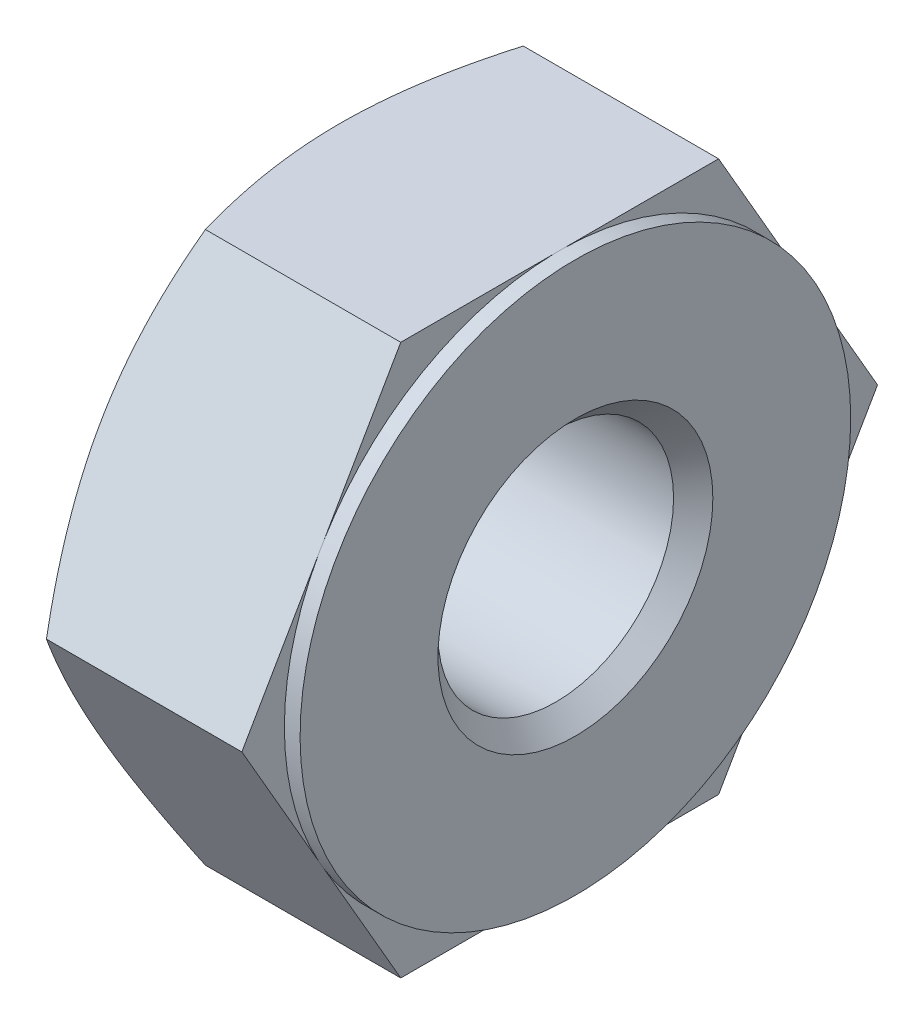
ISO-10303-21;
HEADER;
FILE_DESCRIPTION(('STEP AP214'),'2;1');
FILE_NAME('part.step','',(''),(''),'','','');
FILE_SCHEMA(('AUTOMOTIVE_DESIGN { 1 0 10303 214 1 1 1 1 }'));
ENDSEC;
DATA;
#1=APPLICATION_CONTEXT('core data for automotive mechanical design processes');
#2=APPLICATION_PROTOCOL_DEFINITION('international standard','automotive_design',2000,#1);
#3=PRODUCT_CONTEXT('',#1,'mechanical');
#4=PRODUCT('Part','Part','',(#3));
#5=PRODUCT_RELATED_PRODUCT_CATEGORY('part','',(#4));
#6=PRODUCT_DEFINITION_FORMATION('','',#4);
#7=PRODUCT_DEFINITION_CONTEXT('part definition',#1,'design');
#8=PRODUCT_DEFINITION('design','',#6,#7);
#9=PRODUCT_DEFINITION_SHAPE('','',#8);
#10=(LENGTH_UNIT() NAMED_UNIT(*) SI_UNIT(.MILLI.,.METRE.));
#11=(NAMED_UNIT(*) PLANE_ANGLE_UNIT() SI_UNIT($,.RADIAN.));
#12=(NAMED_UNIT(*) SI_UNIT($,.STERADIAN.) SOLID_ANGLE_UNIT());
#13=UNCERTAINTY_MEASURE_WITH_UNIT(LENGTH_MEASURE(1.E-05),#10,'distance_accuracy_value','');
#14=(GEOMETRIC_REPRESENTATION_CONTEXT(3) GLOBAL_UNCERTAINTY_ASSIGNED_CONTEXT((#13)) GLOBAL_UNIT_ASSIGNED_CONTEXT((#10,
#11,#12)) REPRESENTATION_CONTEXT('',''));
#15=CARTESIAN_POINT('',(0.,0.,0.));
#16=DIRECTION('',(0.,0.,1.));
#17=DIRECTION('',(1.,0.,0.));
#18=AXIS2_PLACEMENT_3D('',#15,#16,#17);
#19=CARTESIAN_POINT('',(9.01523367511831,0.,1.9501205605213));
#20=DIRECTION('',(-1.,0.,0.));
#21=DIRECTION('',(0.,0.,1.));
#22=AXIS2_PLACEMENT_3D('',#19,#20,#21);
#23=PLANE('',#22);
#24=CARTESIAN_POINT('',(9.01523367511832,0.,5.99689052934928));
#25=DIRECTION('',(1.,0.,0.));
#26=DIRECTION('',(0.,0.,-1.));
#27=AXIS2_PLACEMENT_3D('',#24,#25,#26);
#28=CIRCLE('',#27,3.50531808450061);
#29=CARTESIAN_POINT('',(9.01523367511831,1.81350627886718,2.99714889880234));
#30=VERTEX_POINT('',#29);
#31=CARTESIAN_POINT('',(9.01523367511832,3.504605596277,5.92621883720174));
#32=VERTEX_POINT('',#31);
#33=EDGE_CURVE('E232',#30,#32,#28,.T.);
#34=ORIENTED_EDGE('',*,*,#33,.F.);
#35=DIRECTION('',(0.,0.866025403784438,0.500000000000001));
#36=VECTOR('',#35,1.);
#37=CARTESIAN_POINT('',(9.01523367511831,-0.844426972926903,1.46259042039097));
#38=LINE('',#37,#36);
#39=CARTESIAN_POINT('',(9.01523367511832,3.504605596277,3.9735055449353));
#40=VERTEX_POINT('',#39);
#41=EDGE_CURVE('E187',#30,#40,#38,.T.);
#42=ORIENTED_EDGE('',*,*,#41,.T.);
#43=DIRECTION('',(0.,0.,1.));
#44=VECTOR('',#43,1.);
#45=CARTESIAN_POINT('',(9.01523367511831,3.50460559627702,0.));
#46=LINE('',#45,#44);
#47=EDGE_CURVE('E456',#40,#32,#46,.T.);
#48=ORIENTED_EDGE('',*,*,#47,.T.);
#49=EDGE_LOOP('',(#34,#42,#48));
#50=FACE_BOUND('',#49,.T.);
#51=ADVANCED_FACE('F47',(#50),#23,.F.);
#52=CARTESIAN_POINT('',(9.01523367511832,3.504605596277,6.06756222149684));
#53=VERTEX_POINT('',#52);
#54=CARTESIAN_POINT('',(9.01523367511832,1.81350627886629,8.99663215989675));
#55=VERTEX_POINT('',#54);
#56=EDGE_CURVE('E228',#53,#55,#28,.T.);
#57=ORIENTED_EDGE('',*,*,#56,.F.);
#58=CARTESIAN_POINT('',(9.01523367511832,3.50460559627699,8.0202755137633));
#59=VERTEX_POINT('',#58);
#60=EDGE_CURVE('E353',#53,#59,#46,.T.);
#61=ORIENTED_EDGE('',*,*,#60,.T.);
#62=DIRECTION('',(0.,-0.866025403784442,0.499999999999995));
#63=VECTOR('',#62,1.);
#64=CARTESIAN_POINT('',(9.01523367511832,4.34903256920387,7.532745373633));
#65=LINE('',#64,#63);
#66=EDGE_CURVE('E237',#59,#55,#65,.T.);
#67=ORIENTED_EDGE('',*,*,#66,.T.);
#68=EDGE_LOOP('',(#57,#61,#67));
#69=FACE_BOUND('',#68,.T.);
#70=ADVANCED_FACE('F447',(#69),#23,.F.);
#71=CARTESIAN_POINT('',(9.01523367511832,1.69109931741069,9.06730385204382));
#72=VERTEX_POINT('',#71);
#73=CARTESIAN_POINT('',(9.01523367511832,-1.69109931741071,9.06730385204381));
#74=VERTEX_POINT('',#73);
#75=EDGE_CURVE('E224',#72,#74,#28,.T.);
#76=ORIENTED_EDGE('',*,*,#75,.F.);
#77=CARTESIAN_POINT('',(9.01523367511832,0.,10.0436604981773));
#78=VERTEX_POINT('',#77);
#79=EDGE_CURVE('E243',#72,#78,#65,.T.);
#80=ORIENTED_EDGE('',*,*,#79,.T.);
#81=DIRECTION('',(0.,-0.866025403784435,-0.500000000000007));
#82=VECTOR('',#81,1.);
#83=CARTESIAN_POINT('',(9.01523367511832,-4.34903256920395,7.5327453736329));
#84=LINE('',#83,#82);
#85=EDGE_CURVE('E349',#78,#74,#84,.T.);
#86=ORIENTED_EDGE('',*,*,#85,.T.);
#87=EDGE_LOOP('',(#76,#80,#86));
#88=FACE_BOUND('',#87,.T.);
#89=ADVANCED_FACE('F452',(#88),#23,.F.);
#90=CARTESIAN_POINT('',(9.01523367511832,-1.81350627886635,8.99663215989671));
#91=VERTEX_POINT('',#90);
#92=CARTESIAN_POINT('',(9.01523367511832,-3.504605596277,6.06756222149683));
#93=VERTEX_POINT('',#92);
#94=EDGE_CURVE('E199',#91,#93,#28,.T.);
#95=ORIENTED_EDGE('',*,*,#94,.F.);
#96=CARTESIAN_POINT('',(9.01523367511832,-3.50460559627702,8.02027551376325));
#97=VERTEX_POINT('',#96);
#98=EDGE_CURVE('E475',#91,#97,#84,.T.);
#99=ORIENTED_EDGE('',*,*,#98,.T.);
#100=DIRECTION('',(0.,0.,-1.));
#101=VECTOR('',#100,1.);
#102=CARTESIAN_POINT('',(9.01523367511831,-3.50460559627694,0.));
#103=LINE('',#102,#101);
#104=EDGE_CURVE('E384',#97,#93,#103,.T.);
#105=ORIENTED_EDGE('',*,*,#104,.T.);
#106=EDGE_LOOP('',(#95,#99,#105));
#107=FACE_BOUND('',#106,.T.);
#108=ADVANCED_FACE('F444',(#107),#23,.F.);
#109=CARTESIAN_POINT('',(9.01523367511832,-3.504605596277,5.92621883720165));
#110=VERTEX_POINT('',#109);
#111=CARTESIAN_POINT('',(9.01523367511831,-1.81350627886658,2.99714889880199));
#112=VERTEX_POINT('',#111);
#113=EDGE_CURVE('E196',#110,#112,#28,.T.);
#114=ORIENTED_EDGE('',*,*,#113,.F.);
#115=CARTESIAN_POINT('',(9.01523367511832,-3.50460559627698,3.97350554493526));
#116=VERTEX_POINT('',#115);
#117=EDGE_CURVE('E382',#110,#116,#103,.T.);
#118=ORIENTED_EDGE('',*,*,#117,.T.);
#119=DIRECTION('',(0.,0.866025403784441,-0.499999999999995));
#120=VECTOR('',#119,1.);
#121=CARTESIAN_POINT('',(9.01523367511831,0.844426972926896,1.46259042039098));
#122=LINE('',#121,#120);
#123=EDGE_CURVE('E206',#116,#112,#122,.T.);
#124=ORIENTED_EDGE('',*,*,#123,.T.);
#125=EDGE_LOOP('',(#114,#118,#124));
#126=FACE_BOUND('',#125,.T.);
#127=ADVANCED_FACE('F437',(#126),#23,.F.);
#128=CARTESIAN_POINT('',(6.21523367511831,0.,2.49157244484869));
#129=DIRECTION('',(1.,0.,0.));
#130=DIRECTION('',(0.,0.,-1.));
#131=AXIS2_PLACEMENT_3D('',#128,#129,#130);
#132=PLANE('',#131);
#133=CARTESIAN_POINT('',(6.21523367511832,0.,5.99689052934928));
#134=DIRECTION('',(1.,0.,0.));
#135=DIRECTION('',(0.,0.,-1.));
#136=AXIS2_PLACEMENT_3D('',#133,#134,#135);
#137=CIRCLE('',#136,1.74999999999999);
#138=CARTESIAN_POINT('',(6.21523367511831,0.,4.24689052934929));
#139=VERTEX_POINT('',#138);
#140=EDGE_CURVE('E12',#139,#139,#137,.T.);
#141=ORIENTED_EDGE('',*,*,#140,.T.);
#142=EDGE_LOOP('',(#141));
#143=FACE_BOUND('',#142,.T.);
#144=DIRECTION('',(0.,0.866025403784438,0.500000000000001));
#145=VECTOR('',#144,1.);
#146=CARTESIAN_POINT('',(6.21523367511831,-0.844426972926903,1.46259042039097));
#147=LINE('',#146,#145);
#148=CARTESIAN_POINT('',(6.21523367511831,1.69109931741078,2.92647720665481));
#149=VERTEX_POINT('',#148);
#150=CARTESIAN_POINT('',(6.21523367511831,1.81350627886623,2.9971488988018));
#151=VERTEX_POINT('',#150);
#152=EDGE_CURVE('E300',#149,#151,#147,.T.);
#153=ORIENTED_EDGE('',*,*,#152,.F.);
#154=CARTESIAN_POINT('',(6.21523367511832,0.,5.99689052934929));
#155=DIRECTION('',(-1.,0.,0.));
#156=DIRECTION('',(0.,0.,1.));
#157=AXIS2_PLACEMENT_3D('',#154,#155,#156);
#158=CIRCLE('',#157,3.5053180845006);
#159=CARTESIAN_POINT('',(6.21523367511831,-1.69109931741134,2.92647720665512));
#160=VERTEX_POINT('',#159);
#161=EDGE_CURVE('E319',#149,#160,#158,.T.);
#162=ORIENTED_EDGE('',*,*,#161,.T.);
#163=DIRECTION('',(0.,0.866025403784442,-0.499999999999995));
#164=VECTOR('',#163,1.);
#165=CARTESIAN_POINT('',(6.21523367511831,0.844426972926896,1.46259042039099));
#166=LINE('',#165,#164);
#167=CARTESIAN_POINT('',(6.21523367511831,-1.81350627886564,2.99714889880144));
#168=VERTEX_POINT('',#167);
#169=EDGE_CURVE('E307',#168,#160,#166,.T.);
#170=ORIENTED_EDGE('',*,*,#169,.F.);
#171=CARTESIAN_POINT('',(6.21523367511832,-3.504605596277,5.92621883720222));
#172=VERTEX_POINT('',#171);
#173=EDGE_CURVE('E317',#168,#172,#158,.T.);
#174=ORIENTED_EDGE('',*,*,#173,.T.);
#175=DIRECTION('',(0.,0.,-1.));
#176=VECTOR('',#175,1.);
#177=CARTESIAN_POINT('',(6.21523367511832,-3.50460559627694,0.));
#178=LINE('',#177,#176);
#179=CARTESIAN_POINT('',(6.21523367511832,-3.504605596277,6.0675622214963));
#180=VERTEX_POINT('',#179);
#181=EDGE_CURVE('E303',#180,#172,#178,.T.);
#182=ORIENTED_EDGE('',*,*,#181,.F.);
#183=CARTESIAN_POINT('',(6.21523367511832,-1.81350627886633,8.99663215989673));
#184=VERTEX_POINT('',#183);
#185=EDGE_CURVE('E320',#180,#184,#158,.T.);
#186=ORIENTED_EDGE('',*,*,#185,.T.);
#187=DIRECTION('',(0.,-0.866025403784435,-0.500000000000007));
#188=VECTOR('',#187,1.);
#189=CARTESIAN_POINT('',(6.21523367511832,-4.34903256920395,7.5327453736329));
#190=LINE('',#189,#188);
#191=CARTESIAN_POINT('',(6.21523367511832,-1.69109931741071,9.06730385204381));
#192=VERTEX_POINT('',#191);
#193=EDGE_CURVE('E311',#192,#184,#190,.T.);
#194=ORIENTED_EDGE('',*,*,#193,.F.);
#195=CARTESIAN_POINT('',(6.21523367511832,1.69109931741066,9.06730385204384));
#196=VERTEX_POINT('',#195);
#197=EDGE_CURVE('E326',#192,#196,#158,.T.);
#198=ORIENTED_EDGE('',*,*,#197,.T.);
#199=DIRECTION('',(0.,-0.866025403784442,0.499999999999995));
#200=VECTOR('',#199,1.);
#201=CARTESIAN_POINT('',(6.21523367511832,4.34903256920387,7.532745373633));
#202=LINE('',#201,#200);
#203=CARTESIAN_POINT('',(6.21523367511832,1.81350627886629,8.99663215989675));
#204=VERTEX_POINT('',#203);
#205=EDGE_CURVE('E262',#204,#196,#202,.T.);
#206=ORIENTED_EDGE('',*,*,#205,.F.);
#207=CARTESIAN_POINT('',(6.21523367511832,3.504605596277,6.06756222149635));
#208=VERTEX_POINT('',#207);
#209=EDGE_CURVE('E310',#204,#208,#158,.T.);
#210=ORIENTED_EDGE('',*,*,#209,.T.);
#211=DIRECTION('',(0.,0.,1.));
#212=VECTOR('',#211,1.);
#213=CARTESIAN_POINT('',(6.21523367511832,3.50460559627702,0.));
#214=LINE('',#213,#212);
#215=CARTESIAN_POINT('',(6.21523367511832,3.504605596277,5.92621883720227));
#216=VERTEX_POINT('',#215);
#217=EDGE_CURVE('E314',#216,#208,#214,.T.);
#218=ORIENTED_EDGE('',*,*,#217,.F.);
#219=EDGE_CURVE('E321',#216,#151,#158,.T.);
#220=ORIENTED_EDGE('',*,*,#219,.T.);
#221=EDGE_LOOP('',(#153,#162,#170,#174,#182,#186,#194,#198,#206,#210,#218,#220));
#222=FACE_BOUND('',#221,.T.);
#223=ADVANCED_FACE('F336',(#143,#222),#132,.F.);
#224=CARTESIAN_POINT('',(9.01523367511831,-1.69109931741038,2.92647720665456));
#225=VERTEX_POINT('',#224);
#226=CARTESIAN_POINT('',(9.01523367511831,1.69109931740982,2.92647720665425));
#227=VERTEX_POINT('',#226);
#228=EDGE_CURVE('E63',#225,#227,#28,.T.);
#229=ORIENTED_EDGE('',*,*,#228,.F.);
#230=CARTESIAN_POINT('',(9.01523367511831,0.,1.9501205605213));
#231=VERTEX_POINT('',#230);
#232=EDGE_CURVE('E176',#225,#231,#122,.T.);
#233=ORIENTED_EDGE('',*,*,#232,.T.);
#234=EDGE_CURVE('E173',#231,#227,#38,.T.);
#235=ORIENTED_EDGE('',*,*,#234,.T.);
#236=EDGE_LOOP('',(#229,#233,#235));
#237=FACE_BOUND('',#236,.T.);
#238=ADVANCED_FACE('F175',(#237),#23,.F.);
#239=CARTESIAN_POINT('',(6.52784106628796,0.,5.99689052934929));
#240=DIRECTION('',(1.,0.,0.));
#241=DIRECTION('',(0.,0.,-1.));
#242=AXIS2_PLACEMENT_3D('',#239,#240,#241);
#243=CONICAL_SURFACE('',#242,4.04676996882799,1.0471975511966);
#244=CARTESIAN_POINT('',(6.52790773580793,-0.000199999999997301,1.95000509046747));
#245=CARTESIAN_POINT('',(6.47655198186036,0.153809566516119,2.03892255515332));
#246=CARTESIAN_POINT('',(6.42984577511724,0.309148533972665,2.12860754983));
#247=CARTESIAN_POINT('',(6.34831957460338,0.622516334326462,2.30953053371963));
#248=CARTESIAN_POINT('',(6.31352842188457,0.780550735388633,2.40077173771409));
#249=CARTESIAN_POINT('',(6.25937085826067,1.0946609950491,2.58212338068428));
#250=CARTESIAN_POINT('',(6.23964400125341,1.25068852355232,2.67220591626661));
#251=CARTESIAN_POINT('',(6.21609411511932,1.56347775531863,2.85279486342651));
#252=CARTESIAN_POINT('',(6.21225158478046,1.72023832165344,2.94330061859823));
#253=CARTESIAN_POINT('',(6.22024475829277,2.01315498412356,3.11241613252548));
#254=CARTESIAN_POINT('',(6.23011786674248,2.14935492549422,3.19105120533944));
#255=CARTESIAN_POINT('',(6.26141001837264,2.42086746519949,3.34780904322664));
#256=CARTESIAN_POINT('',(6.28283975133466,2.55617912440269,3.4259312660921));
#257=CARTESIAN_POINT('',(6.33641250191811,2.82825148589846,3.58301231724074));
#258=CARTESIAN_POINT('',(6.36878261611802,2.96497775251995,3.66195126407995));
#259=CARTESIAN_POINT('',(6.44225007523395,3.23639102713107,3.81865179123832));
#260=CARTESIAN_POINT('',(6.48333015744971,3.37108151241666,3.89641537917524));
#261=CARTESIAN_POINT('',(6.52790773580793,3.504805596277,3.97362101498914));
#262=B_SPLINE_CURVE_WITH_KNOTS('',3,(#244,#245,#246,#247,#248,#249,#250,#251,#252,#253,#254,
#255,#256,#257,#258,#259,#260,#261),.UNSPECIFIED.,.F.,.F.,(4,2,2,2,2,2,2,2,4),(0.,
0.555523856766706,1.11238304016832,1.65546014174655,2.1978703083649,2.67016009995162,
3.14288750687598,3.6261008954237,4.10836538614338),.UNSPECIFIED.);
#263=CARTESIAN_POINT('',(6.52784106628796,0.,1.9501205605213));
#264=VERTEX_POINT('',#263);
#265=EDGE_CURVE('E302',#264,#149,#262,.T.);
#266=ORIENTED_EDGE('',*,*,#265,.F.);
#267=CARTESIAN_POINT('',(7.63942238244528,-5.94010134878504,5.37963967325596));
#268=CARTESIAN_POINT('',(7.57998961243419,-5.82997739974507,5.31605958163351));
#269=CARTESIAN_POINT('',(7.52119742724885,-5.7195901265507,5.25232745973963));
#270=CARTESIAN_POINT('',(7.40519501435212,-5.49817790120754,5.12449505183589));
#271=CARTESIAN_POINT('',(7.34798498556296,-5.38715287097476,5.0603947207442));
#272=CARTESIAN_POINT('',(7.23528241265301,-5.16402467671095,4.9315715977222));
#273=CARTESIAN_POINT('',(7.17979595982228,-5.05191919787322,4.86684746933761));
#274=CARTESIAN_POINT('',(7.0711460996325,-4.82686888063744,4.73691460810032));
#275=CARTESIAN_POINT('',(7.01798261860783,-4.71392406898923,4.67170589069165));
#276=CARTESIAN_POINT('',(6.91316583536851,-4.48416401493904,4.53905386163676));
#277=CARTESIAN_POINT('',(6.86158578292259,-4.3673235954558,4.47159601399588));
#278=CARTESIAN_POINT('',(6.76210102525412,-4.13247674431095,4.33600712126907));
#279=CARTESIAN_POINT('',(6.71419610645899,-4.01447038085624,4.2678761155624));
#280=CARTESIAN_POINT('',(6.62296340456288,-3.77724729424417,4.13091530264893));
#281=CARTESIAN_POINT('',(6.57963145832201,-3.6580317821842,4.06208619466953));
#282=CARTESIAN_POINT('',(6.49854858957115,-3.41819489671866,3.9236163042844));
#283=CARTESIAN_POINT('',(6.46079694768049,-3.29757370669169,3.85397562775236));
#284=CARTESIAN_POINT('',(6.37913316402746,-3.0091651131697,3.68746284864583));
#285=CARTESIAN_POINT('',(6.33825214991654,-2.84071633906093,3.59020890356947));
#286=CARTESIAN_POINT('',(6.27274638685567,-2.50142555689638,3.39431927915322));
#287=CARTESIAN_POINT('',(6.24811596006098,-2.33058440604901,3.29568409472282));
#288=CARTESIAN_POINT('',(6.22540922521524,-2.0744090351387,3.14778117536801));
#289=CARTESIAN_POINT('',(6.22020331338452,-1.98952286561289,3.09877212254181));
#290=CARTESIAN_POINT('',(6.21453118856414,-1.81962673074213,3.0006825433399));
#291=CARTESIAN_POINT('',(6.21406492546924,-1.73461676671538,2.95160201772525));
#292=CARTESIAN_POINT('',(6.21789384236217,-1.56467590088275,2.85348661309047));
#293=CARTESIAN_POINT('',(6.22218918830991,-1.47974500193586,2.80445173572096));
#294=CARTESIAN_POINT('',(6.23540917679844,-1.31015190619197,2.70653711624053));
#295=CARTESIAN_POINT('',(6.24433414250601,-1.22548972856798,2.65765738519914));
#296=CARTESIAN_POINT('',(6.27064791023379,-1.02558546786977,2.54224260647287));
#297=CARTESIAN_POINT('',(6.28994123081508,-0.910529990902257,2.47581529587394));
#298=CARTESIAN_POINT('',(6.33581817084866,-0.681517570724018,2.34359491343627));
#299=CARTESIAN_POINT('',(6.36240285010049,-0.56756078970327,2.27780193523796));
#300=CARTESIAN_POINT('',(6.42185905691839,-0.340760831838172,2.14685891851235));
#301=CARTESIAN_POINT('',(6.45473768181666,-0.22791906485642,2.0817096939696));
#302=CARTESIAN_POINT('',(6.52574614887122,-0.00350133763502364,1.95214205874741));
#303=CARTESIAN_POINT('',(6.56387565894073,0.10807470217159,1.88772360212995));
#304=CARTESIAN_POINT('',(6.64495933838875,0.331363265254297,1.75880789012718));
#305=CARTESIAN_POINT('',(6.68796574753002,0.443061466718441,1.69431890344386));
#306=CARTESIAN_POINT('',(6.77760213147093,0.665271472122561,1.56602589700717));
#307=CARTESIAN_POINT('',(6.82422970424994,0.775784008094973,1.50222145461467));
#308=CARTESIAN_POINT('',(6.96854787780255,1.10580649815144,1.31168288114194));
#309=CARTESIAN_POINT('',(7.07069486032152,1.32385690134501,1.18579142216123));
#310=CARTESIAN_POINT('',(7.21392756317926,1.61602591991813,1.01710756063917));
#311=CARTESIAN_POINT('',(7.25149436788595,1.69147344627413,0.973547910987842));
#312=CARTESIAN_POINT('',(7.32750277622736,1.84203644922975,0.886620320701418));
#313=CARTESIAN_POINT('',(7.36594435057548,1.91715193684551,0.84325237370615));
#314=CARTESIAN_POINT('',(7.44318223985778,2.06628794172789,0.75714866114144));
#315=CARTESIAN_POINT('',(7.48197045357195,2.14031161646565,0.714411072605193));
#316=CARTESIAN_POINT('',(7.56021566304786,2.28809507385016,0.629088253702474));
#317=CARTESIAN_POINT('',(7.59967267051865,2.36185485184924,0.586503026019336));
#318=CARTESIAN_POINT('',(7.63942238244528,2.43549575250807,0.543986432200598));
#319=B_SPLINE_CURVE_WITH_KNOTS('',3,(#267,#268,#269,#270,#271,#272,#273,#274,#275,#276,#277,
#278,#279,#280,#281,#282,#283,#284,#285,#286,#287,#288,#289,#290,#291,#292,#293,#294,#295,#296,
#297,#298,#299,#300,#301,#302,#303,#304,#305,#306,#307,#308,#309,#310,#311,#312,#313,#314,#315,
#316,#317,#318),.UNSPECIFIED.,.F.,.F.,(4,2,2,2,2,2,2,2,2,2,2,2,2,2,2,2,2,2,2,2,2,2,2,2,2,4),(0.,
0.421095586095047,0.842243877423023,1.26474176490681,1.68722624448425,2.12050114861326,
2.55375085478938,2.98660267367378,3.41939864304022,4.01512627135809,4.61064564611191,
4.90501583659645,5.19938291514063,5.49376025380307,5.78815814399773,6.19065941980799,
6.5932192302425,6.99623568786597,7.3992266688277,7.80703648914611,8.21457807097681,
9.02945899044465,9.31408130639947,9.59869410739856,9.88028474205919,10.1618803118352),.UNSPECIFIED.);
#320=EDGE_CURVE('E201',#160,#264,#319,.T.);
#321=ORIENTED_EDGE('',*,*,#320,.F.);
#322=ORIENTED_EDGE('',*,*,#161,.F.);
#323=EDGE_LOOP('',(#266,#321,#322));
#324=FACE_BOUND('',#323,.T.);
#325=ADVANCED_FACE('F443',(#324),#243,.T.);
#326=CARTESIAN_POINT('',(6.52784106628796,3.504605596277,3.9735055449353));
#327=VERTEX_POINT('',#326);
#328=EDGE_CURVE('E179',#151,#327,#262,.T.);
#329=ORIENTED_EDGE('',*,*,#328,.F.);
#330=ORIENTED_EDGE('',*,*,#219,.F.);
#331=CARTESIAN_POINT('',(7.46577583410324,3.50460559627701,1.53800979242721));
#332=CARTESIAN_POINT('',(7.40831416214057,3.50460559627701,1.66463292422941));
#333=CARTESIAN_POINT('',(7.35160078393124,3.50460559627701,1.79160201741177));
#334=CARTESIAN_POINT('',(7.24003348945727,3.50460559627701,2.04638074214783));
#335=CARTESIAN_POINT('',(7.18517990977941,3.50460559627701,2.17419052090412));
#336=CARTESIAN_POINT('',(7.07749192627333,3.50460559627701,2.43128880046208));
#337=CARTESIAN_POINT('',(7.02466689883435,3.50460559627701,2.56058124549351));
#338=CARTESIAN_POINT('',(6.92178133211271,3.50460559627701,2.82025714497044));
#339=CARTESIAN_POINT('',(6.87172066577147,3.50460559627701,2.95064054895437));
#340=CARTESIAN_POINT('',(6.77519152620521,3.50460559627701,3.21208299709996));
#341=CARTESIAN_POINT('',(6.7287080517677,3.50460559627701,3.3431364484971));
#342=CARTESIAN_POINT('',(6.63985141318327,3.50460559627701,3.60662666266784));
#343=CARTESIAN_POINT('',(6.59747851124213,3.50460559627701,3.73906351308981));
#344=CARTESIAN_POINT('',(6.47797445741147,3.504605596277,4.13831115026192));
#345=CARTESIAN_POINT('',(6.40829354517167,3.504605596277,4.40748800786949));
#346=CARTESIAN_POINT('',(6.31341116808281,3.504605596277,4.87472216300438));
#347=CARTESIAN_POINT('',(6.28120186405437,3.504605596277,5.0713347725773));
#348=CARTESIAN_POINT('',(6.23480142375391,3.504605596277,5.46669389494947));
#349=CARTESIAN_POINT('',(6.22060426367489,3.504605596277,5.66543967191703));
#350=CARTESIAN_POINT('',(6.21193307293221,3.504605596277,6.06327229585966));
#351=CARTESIAN_POINT('',(6.21744844621454,3.504605596277,6.26235890211959));
#352=CARTESIAN_POINT('',(6.24748241363508,3.504605596277,6.65905715324727));
#353=CARTESIAN_POINT('',(6.27200417509332,3.504605596277,6.85666854673606));
#354=CARTESIAN_POINT('',(6.35374710265866,3.50460559627699,7.34752890351585));
#355=CARTESIAN_POINT('',(6.42119863640871,3.50460559627699,7.63905438129734));
#356=CARTESIAN_POINT('',(6.54149090366201,3.50460559627699,8.0710152970608));
#357=CARTESIAN_POINT('',(6.58484503081389,3.50460559627699,8.21430255336605));
#358=CARTESIAN_POINT('',(6.67672394788257,3.50460559627699,8.49921715356136));
#359=CARTESIAN_POINT('',(6.7252483744038,3.50460559627699,8.64084461333493));
#360=CARTESIAN_POINT('',(6.82702869058875,3.50460559627699,8.92421309873922));
#361=CARTESIAN_POINT('',(6.8803326262009,3.50460559627699,9.06593665534471));
#362=CARTESIAN_POINT('',(6.9903528053279,3.50460559627699,9.34805929792589));
#363=CARTESIAN_POINT('',(7.04706926388774,3.50460559627699,9.48845829978661));
#364=CARTESIAN_POINT('',(7.16288221748141,3.50460559627699,9.76723924077303));
#365=CARTESIAN_POINT('',(7.22196166606334,3.50460559627698,9.90562829841966));
#366=CARTESIAN_POINT('',(7.34232982524449,3.50460559627698,10.1814030495535));
#367=CARTESIAN_POINT('',(7.40361798629842,3.50460559627698,10.3187889825344));
#368=CARTESIAN_POINT('',(7.46577583410325,3.50460559627698,10.4557712662714));
#369=B_SPLINE_CURVE_WITH_KNOTS('',3,(#331,#332,#333,#334,#335,#336,#337,#338,#339,#340,#341,
#342,#343,#344,#345,#346,#347,#348,#349,#350,#351,#352,#353,#354,#355,#356,#357,#358,#359,#360,
#361,#362,#363,#364,#365,#366,#367,#368),.UNSPECIFIED.,.F.,.F.,(4,2,2,2,2,2,2,2,2,2,2,2,2,2,2,2,
2,2,4),(0.,0.417160024325151,0.834395147688542,1.25337057658095,1.67232673201027,
2.0894175632983,2.50653498256636,3.33939404809333,3.93641650381656,4.53323924445499,
5.12974122395335,5.72634262891654,6.62205828003672,7.071119621818,7.5201494220219,
7.97434945963544,8.42857814934714,8.87997442018264,9.33125914507681),.UNSPECIFIED.);
#370=EDGE_CURVE('E358',#327,#216,#369,.T.);
#371=ORIENTED_EDGE('',*,*,#370,.F.);
#372=EDGE_LOOP('',(#329,#330,#371));
#373=FACE_BOUND('',#372,.T.);
#374=ADVANCED_FACE('F567',(#373),#243,.T.);
#375=CARTESIAN_POINT('',(8.25406671155372,-3.50460559627706,12.0987436870065));
#376=CARTESIAN_POINT('',(8.18101973882412,-3.50460559627706,11.9528163953164));
#377=CARTESIAN_POINT('',(8.10847402504984,-3.50460559627706,11.8066355390987));
#378=CARTESIAN_POINT('',(7.96462750938325,-3.50460559627706,11.5136509872544));
#379=CARTESIAN_POINT('',(7.89332679033043,-3.50460559627705,11.3668472509844));
#380=CARTESIAN_POINT('',(7.75208094236501,-3.50460559627705,11.0722254670328));
#381=CARTESIAN_POINT('',(7.68213881823109,-3.50460559627705,10.9244059757625));
#382=CARTESIAN_POINT('',(7.54409452901697,-3.50460559627705,10.6279122293212));
#383=CARTESIAN_POINT('',(7.47599232810123,-3.50460559627705,10.4792379908664));
#384=CARTESIAN_POINT('',(7.33902497408163,-3.50460559627704,10.1741246696489));
#385=CARTESIAN_POINT('',(7.27026453019619,-3.50460559627704,10.0176384255758));
#386=CARTESIAN_POINT('',(7.13585817451069,-3.50460559627704,9.70333546684826));
#387=CARTESIAN_POINT('',(7.07021215481796,-3.50460559627704,9.54551879850707));
#388=CARTESIAN_POINT('',(6.94290956510655,-3.50460559627703,9.22838054483295));
#389=CARTESIAN_POINT('',(6.88125070385577,-3.50460559627703,9.06905988519753));
#390=CARTESIAN_POINT('',(6.76299734105678,-3.50460559627703,8.74856078351674));
#391=CARTESIAN_POINT('',(6.70640228597216,-3.50460559627703,8.58738254670705));
#392=CARTESIAN_POINT('',(6.58728078419806,-3.50460559627702,8.2251172216703));
#393=CARTESIAN_POINT('',(6.52643599419309,-3.50460559627702,8.0234664039462));
#394=CARTESIAN_POINT('',(6.41802607990879,-3.50460559627701,7.61657265116357));
#395=CARTESIAN_POINT('',(6.37045982474574,-3.50460559627701,7.41133002358933));
#396=CARTESIAN_POINT('',(6.29331376014482,-3.50460559627701,7.0009759782948));
#397=CARTESIAN_POINT('',(6.26344077280396,-3.50460559627701,6.79592212935934));
#398=CARTESIAN_POINT('',(6.2336627607304,-3.504605596277,6.48695956201031));
#399=CARTESIAN_POINT('',(6.22624199629239,-3.504605596277,6.38374757316026));
#400=CARTESIAN_POINT('',(6.21662344875554,-3.504605596277,6.17707291759378));
#401=CARTESIAN_POINT('',(6.21442564229653,-3.504605596277,6.0736102520006));
#402=CARTESIAN_POINT('',(6.21533949517086,-3.504605596277,5.86607638600956));
#403=CARTESIAN_POINT('',(6.21848367193905,-3.504605596277,5.76200532927301));
#404=CARTESIAN_POINT('',(6.23002822778642,-3.50460559627699,5.55414995277792));
#405=CARTESIAN_POINT('',(6.23842929722124,-3.50460559627699,5.45036567247825));
#406=CARTESIAN_POINT('',(6.27114874597808,-3.50460559627699,5.13976108518465));
#407=CARTESIAN_POINT('',(6.30298321607127,-3.50460559627699,4.93370668958455));
#408=CARTESIAN_POINT('',(6.38389896030162,-3.50460559627698,4.52148858582536));
#409=CARTESIAN_POINT('',(6.43326645283878,-3.50460559627698,4.31538352162376));
#410=CARTESIAN_POINT('',(6.54506937576075,-3.50460559627698,3.9066939085813));
#411=CARTESIAN_POINT('',(6.607512228214,-3.50460559627697,3.70411143033365));
#412=CARTESIAN_POINT('',(6.72805496646932,-3.50460559627697,3.3440025837237));
#413=CARTESIAN_POINT('',(6.78435960955415,-3.50460559627697,3.18586373056073));
#414=CARTESIAN_POINT('',(6.90169644722637,-3.50460559627697,2.87140683014621));
#415=CARTESIAN_POINT('',(6.9627273349621,-3.50460559627696,2.71508829321525));
#416=CARTESIAN_POINT('',(7.08855186492158,-3.50460559627696,2.40385544615607));
#417=CARTESIAN_POINT('',(7.15334810271372,-3.50460559627696,2.24894219185201));
#418=CARTESIAN_POINT('',(7.28588966180924,-3.50460559627696,1.94038115188107));
#419=CARTESIAN_POINT('',(7.35363507619849,-3.50460559627695,1.78673340634017));
#420=CARTESIAN_POINT('',(7.48854368826051,-3.50460559627695,1.48702449949604));
#421=CARTESIAN_POINT('',(7.5556087209235,-3.50460559627695,1.34091901082464));
#422=CARTESIAN_POINT('',(7.69149663777367,-3.50460559627695,1.04953203867016));
#423=CARTESIAN_POINT('',(7.76031949459499,-3.50460559627695,0.90425054240211));
#424=CARTESIAN_POINT('',(7.89928316009976,-3.50460559627694,0.614642980816803));
#425=CARTESIAN_POINT('',(7.96942136756245,-3.50460559627694,0.470315664802877));
#426=CARTESIAN_POINT('',(8.11090021007703,-3.50460559627694,0.182256238294372));
#427=CARTESIAN_POINT('',(8.18224081121474,-3.50460559627694,0.0385241111541297));
#428=CARTESIAN_POINT('',(8.2540667115537,-3.50460559627693,-0.104962628308032));
#429=B_SPLINE_CURVE_WITH_KNOTS('',3,(#375,#376,#377,#378,#379,#380,#381,#382,#383,#384,#385,
#386,#387,#388,#389,#390,#391,#392,#393,#394,#395,#396,#397,#398,#399,#400,#401,#402,#403,#404,
#405,#406,#407,#408,#409,#410,#411,#412,#413,#414,#415,#416,#417,#418,#419,#420,#421,#422,#423,
#424,#425,#426,#427,#428),.UNSPECIFIED.,.F.,.F.,(4,2,2,2,2,2,2,2,2,2,2,2,2,2,2,2,2,2,2,2,2,2,2,
2,2,2,4),(0.,0.489569425115306,0.979171302035257,1.46975488732166,1.96032891078365,
2.47308225824889,2.98581782946379,3.49825608812632,4.01063826236194,4.64218419247401,
5.2736763197326,5.89438851502555,6.20470977479477,6.51502964662081,6.827245255941,
7.1395018752396,7.76406785183812,8.39933736209619,9.03496845764001,9.53847493166689,
10.0418426750905,10.5455616186703,11.049296472849,11.5315697206926,12.0138354650618,
12.4952313075186,12.976613594586),.UNSPECIFIED.);
#430=CARTESIAN_POINT('',(6.52784106628796,-3.50460559627702,8.02027551376326));
#431=VERTEX_POINT('',#430);
#432=EDGE_CURVE('E248',#431,#180,#429,.T.);
#433=ORIENTED_EDGE('',*,*,#432,.F.);
#434=CARTESIAN_POINT('',(7.63942238244532,2.43549575250806,11.449794626498));
#435=CARTESIAN_POINT('',(7.57998961243423,2.32537180346809,11.3862145348756));
#436=CARTESIAN_POINT('',(7.52119742724889,2.21498453027373,11.3224824129817));
#437=CARTESIAN_POINT('',(7.40519501435216,1.99357230493057,11.194650005078));
#438=CARTESIAN_POINT('',(7.34798498556299,1.88254727469779,11.1305496739863));
#439=CARTESIAN_POINT('',(7.23528241265305,1.65941908043398,11.0017265509643));
#440=CARTESIAN_POINT('',(7.17979595982232,1.54731360159625,10.9370024225797));
#441=CARTESIAN_POINT('',(7.07114609963253,1.32226328436047,10.8070695613424));
#442=CARTESIAN_POINT('',(7.01798261860786,1.20931847271226,10.7418608439337));
#443=CARTESIAN_POINT('',(6.91316583536855,0.979558418662074,10.6092088148788));
#444=CARTESIAN_POINT('',(6.86158578292262,0.862717999178838,10.5417509672379));
#445=CARTESIAN_POINT('',(6.76210102525414,0.627871148033987,10.4061620745111));
#446=CARTESIAN_POINT('',(6.71419610645902,0.509864784579282,10.3380310688045));
#447=CARTESIAN_POINT('',(6.6229634045629,0.272641697967208,10.201070255891));
#448=CARTESIAN_POINT('',(6.57963145832203,0.153426185907238,10.1322411479116));
#449=CARTESIAN_POINT('',(6.49854858957117,-0.086410699558296,9.99377125752645));
#450=CARTESIAN_POINT('',(6.46079694768051,-0.20703188958527,9.9241305809944));
#451=CARTESIAN_POINT('',(6.37913316402747,-0.495440483107258,9.75761780188788));
#452=CARTESIAN_POINT('',(6.33825214991655,-0.663889257216027,9.66036385681152));
#453=CARTESIAN_POINT('',(6.27274638685568,-1.00318003938057,9.46447423239526));
#454=CARTESIAN_POINT('',(6.24811596006099,-1.17402119022794,9.36583904796486));
#455=CARTESIAN_POINT('',(6.22540922521524,-1.43019656113824,9.21793612861004));
#456=CARTESIAN_POINT('',(6.22020331338452,-1.51508273066405,9.16892707578384));
#457=CARTESIAN_POINT('',(6.21453118856414,-1.68497886553481,9.07083749658193));
#458=CARTESIAN_POINT('',(6.21406492546924,-1.76998882956156,9.02175697096728));
#459=CARTESIAN_POINT('',(6.21789384236216,-1.93992969539418,8.9236415663325));
#460=CARTESIAN_POINT('',(6.2221891883099,-2.02486059434107,8.87460668896299));
#461=CARTESIAN_POINT('',(6.23540917679843,-2.19445369008496,8.77669206948256));
#462=CARTESIAN_POINT('',(6.244334142506,-2.27911586770895,8.72781233844116));
#463=CARTESIAN_POINT('',(6.27064791023377,-2.47902012840716,8.6123975597149));
#464=CARTESIAN_POINT('',(6.28994123081507,-2.59407560537466,8.54597024911597));
#465=CARTESIAN_POINT('',(6.33581817084864,-2.82308802555289,8.4137498666783));
#466=CARTESIAN_POINT('',(6.36240285010046,-2.93704480657364,8.34795688847999));
#467=CARTESIAN_POINT('',(6.42185905691836,-3.16384476443872,8.21701387175438));
#468=CARTESIAN_POINT('',(6.45473768181662,-3.27668653142047,8.15186464721163));
#469=CARTESIAN_POINT('',(6.52574614887118,-3.50110425864186,8.02229701198944));
#470=CARTESIAN_POINT('',(6.56387565894069,-3.61268029844847,7.95787855537198));
#471=CARTESIAN_POINT('',(6.6449593383887,-3.83596886153116,7.82896284336922));
#472=CARTESIAN_POINT('',(6.68796574752997,-3.9476670629953,7.7644738566859));
#473=CARTESIAN_POINT('',(6.77760213147088,-4.16987706839941,7.6361808502492));
#474=CARTESIAN_POINT('',(6.82422970424988,-4.28038960437182,7.5723764078567));
#475=CARTESIAN_POINT('',(6.96854787780248,-4.61041209442827,7.38183783438398));
#476=CARTESIAN_POINT('',(7.07069486032144,-4.82846249762184,7.25594637540326));
#477=CARTESIAN_POINT('',(7.21392756317919,-5.12063151619496,7.0872625138812));
#478=CARTESIAN_POINT('',(7.25149436788588,-5.19607904255099,7.04370286422986));
#479=CARTESIAN_POINT('',(7.32750277622732,-5.34664204550664,6.95677527394341));
#480=CARTESIAN_POINT('',(7.36594435057544,-5.42175753312242,6.91340732694813));
#481=CARTESIAN_POINT('',(7.44318223985776,-5.57089353800484,6.82730361438339));
#482=CARTESIAN_POINT('',(7.48197045357195,-5.64491721274262,6.78456602584713));
#483=CARTESIAN_POINT('',(7.56021566304788,-5.79270067012716,6.69924320694439));
#484=CARTESIAN_POINT('',(7.59967267051868,-5.86646044812627,6.65665797926124));
#485=CARTESIAN_POINT('',(7.63942238244531,-5.94010134878511,6.61414138544249));
#486=B_SPLINE_CURVE_WITH_KNOTS('',3,(#434,#435,#436,#437,#438,#439,#440,#441,#442,#443,#444,
#445,#446,#447,#448,#449,#450,#451,#452,#453,#454,#455,#456,#457,#458,#459,#460,#461,#462,#463,
#464,#465,#466,#467,#468,#469,#470,#471,#472,#473,#474,#475,#476,#477,#478,#479,#480,#481,#482,
#483,#484,#485),.UNSPECIFIED.,.F.,.F.,(4,2,2,2,2,2,2,2,2,2,2,2,2,2,2,2,2,2,2,2,2,2,2,2,2,4),(0.,
0.421095586095047,0.842243877423025,1.26474176490681,1.68722624448426,2.12050114861327,
2.55375085478939,2.98660267367378,3.41939864304023,4.0151262713581,4.61064564611192,
4.90501583659646,5.19938291514064,5.49376025380307,5.78815814399773,6.19065941980798,
6.59321923024248,6.99623568786593,7.39922666882764,7.80703648914603,8.21457807097672,
9.02945899044453,9.31408130639942,9.59869410739859,9.88028474205928,10.1618803118354),.UNSPECIFIED.);
#487=EDGE_CURVE('E363',#184,#431,#486,.T.);
#488=ORIENTED_EDGE('',*,*,#487,.F.);
#489=ORIENTED_EDGE('',*,*,#185,.F.);
#490=EDGE_LOOP('',(#433,#488,#489));
#491=FACE_BOUND('',#490,.T.);
#492=ADVANCED_FACE('F265',(#491),#243,.T.);
#493=CARTESIAN_POINT('',(6.52784106628796,-3.50460559627698,3.97350554493526));
#494=VERTEX_POINT('',#493);
#495=EDGE_CURVE('E305',#172,#494,#429,.T.);
#496=ORIENTED_EDGE('',*,*,#495,.F.);
#497=ORIENTED_EDGE('',*,*,#173,.F.);
#498=EDGE_CURVE('E197',#494,#168,#319,.T.);
#499=ORIENTED_EDGE('',*,*,#498,.F.);
#500=EDGE_LOOP('',(#496,#497,#499));
#501=FACE_BOUND('',#500,.T.);
#502=ADVANCED_FACE('F556',(#501),#243,.T.);
#503=CARTESIAN_POINT('',(6.52790773580794,3.50480559627699,8.02016004370947));
#504=CARTESIAN_POINT('',(6.47655198186037,3.35079602976087,8.10907750839532));
#505=CARTESIAN_POINT('',(6.42984577511724,3.19545706230433,8.198762503072));
#506=CARTESIAN_POINT('',(6.34831957460338,2.88208926195053,8.37968548696162));
#507=CARTESIAN_POINT('',(6.31352842188457,2.72405486088836,8.47092669095609));
#508=CARTESIAN_POINT('',(6.25937085826068,2.40994460122789,8.65227833392628));
#509=CARTESIAN_POINT('',(6.23964400125341,2.25391707272466,8.74236086950861));
#510=CARTESIAN_POINT('',(6.21609411511932,1.94112784095836,8.9229498166685));
#511=CARTESIAN_POINT('',(6.21225158478046,1.78436727462354,9.01345557184022));
#512=CARTESIAN_POINT('',(6.22024475829277,1.49145061215343,9.18257108576747));
#513=CARTESIAN_POINT('',(6.23011786674249,1.35525067078276,9.26120615858143));
#514=CARTESIAN_POINT('',(6.26141001837264,1.0837381310775,9.41796399646862));
#515=CARTESIAN_POINT('',(6.28283975133466,0.948426471874294,9.49608621933409));
#516=CARTESIAN_POINT('',(6.33641250191812,0.676354110378523,9.65316727048272));
#517=CARTESIAN_POINT('',(6.36878261611803,0.539627843757028,9.73210621732193));
#518=CARTESIAN_POINT('',(6.44225007523396,0.268214569145907,9.8888067444803));
#519=CARTESIAN_POINT('',(6.48333015744972,0.133524083860316,9.96657033241722));
#520=CARTESIAN_POINT('',(6.52790773580794,-0.000200000000026289,10.0437759682311));
#521=B_SPLINE_CURVE_WITH_KNOTS('',3,(#503,#504,#505,#506,#507,#508,#509,#510,#511,#512,#513,
#514,#515,#516,#517,#518,#519,#520),.UNSPECIFIED.,.F.,.F.,(4,2,2,2,2,2,2,2,4),(0.,
0.555523856766705,1.11238304016832,1.65546014174655,2.1978703083649,2.67016009995162,
3.14288750687598,3.62610089542371,4.10836538614338),.UNSPECIFIED.);
#522=CARTESIAN_POINT('',(6.52784106628796,3.50460559627699,8.0202755137633));
#523=VERTEX_POINT('',#522);
#524=EDGE_CURVE('E256',#523,#204,#521,.T.);
#525=ORIENTED_EDGE('',*,*,#524,.F.);
#526=EDGE_CURVE('E328',#208,#523,#369,.T.);
#527=ORIENTED_EDGE('',*,*,#526,.F.);
#528=ORIENTED_EDGE('',*,*,#209,.F.);
#529=EDGE_LOOP('',(#525,#527,#528));
#530=FACE_BOUND('',#529,.T.);
#531=ADVANCED_FACE('F572',(#530),#243,.T.);
#532=CARTESIAN_POINT('',(6.52784106628796,0.,10.0436604981773));
#533=VERTEX_POINT('',#532);
#534=EDGE_CURVE('E241',#196,#533,#521,.T.);
#535=ORIENTED_EDGE('',*,*,#534,.F.);
#536=ORIENTED_EDGE('',*,*,#197,.F.);
#537=EDGE_CURVE('E341',#533,#192,#486,.T.);
#538=ORIENTED_EDGE('',*,*,#537,.F.);
#539=EDGE_LOOP('',(#535,#536,#538));
#540=FACE_BOUND('',#539,.T.);
#541=ADVANCED_FACE('F340',(#540),#243,.T.);
#542=CARTESIAN_POINT('',(5.51523367511831,3.50460559627702,0.));
#543=DIRECTION('',(0.,1.,0.));
#544=DIRECTION('',(0.,0.,1.));
#545=AXIS2_PLACEMENT_3D('',#542,#543,#544);
#546=PLANE('',#545);
#547=ORIENTED_EDGE('',*,*,#370,.T.);
#548=ORIENTED_EDGE('',*,*,#217,.T.);
#549=ORIENTED_EDGE('',*,*,#526,.T.);
#550=DIRECTION('',(1.,0.,0.));
#551=VECTOR('',#550,1.);
#552=CARTESIAN_POINT('',(5.51523367511832,3.50460559627699,8.0202755137633));
#553=LINE('',#552,#551);
#554=EDGE_CURVE('E316',#523,#59,#553,.T.);
#555=ORIENTED_EDGE('',*,*,#554,.T.);
#556=ORIENTED_EDGE('',*,*,#60,.F.);
#557=CARTESIAN_POINT('',(9.01523367511832,0.,5.99689052934928));
#558=DIRECTION('',(1.,0.,0.));
#559=DIRECTION('',(0.,0.999796740778885,-0.0201612779336713));
#560=AXIS2_PLACEMENT_3D('',#557,#558,#559);
#561=CIRCLE('',#560,3.50531808450061);
#562=EDGE_CURVE('E464',#32,#53,#561,.T.);
#563=ORIENTED_EDGE('',*,*,#562,.F.);
#564=ORIENTED_EDGE('',*,*,#47,.F.);
#565=DIRECTION('',(1.,0.,0.));
#566=VECTOR('',#565,1.);
#567=CARTESIAN_POINT('',(5.51523367511832,3.504605596277,3.9735055449353));
#568=LINE('',#567,#566);
#569=EDGE_CURVE('E463',#327,#40,#568,.T.);
#570=ORIENTED_EDGE('',*,*,#569,.F.);
#571=EDGE_LOOP('',(#547,#548,#549,#555,#556,#563,#564,#570));
#572=FACE_BOUND('',#571,.T.);
#573=ADVANCED_FACE('F283',(#572),#546,.T.);
#574=CARTESIAN_POINT('',(5.51523367511832,-4.34903256920395,7.5327453736329));
#575=DIRECTION('',(0.,-0.500000000000007,0.866025403784435));
#576=DIRECTION('',(0.,-0.866025403784435,-0.500000000000007));
#577=AXIS2_PLACEMENT_3D('',#574,#575,#576);
#578=PLANE('',#577);
#579=ORIENTED_EDGE('',*,*,#537,.T.);
#580=ORIENTED_EDGE('',*,*,#193,.T.);
#581=ORIENTED_EDGE('',*,*,#487,.T.);
#582=DIRECTION('',(1.,0.,0.));
#583=VECTOR('',#582,1.);
#584=CARTESIAN_POINT('',(5.51523367511832,-3.50460559627702,8.02027551376326));
#585=LINE('',#584,#583);
#586=EDGE_CURVE('E350',#431,#97,#585,.T.);
#587=ORIENTED_EDGE('',*,*,#586,.T.);
#588=ORIENTED_EDGE('',*,*,#98,.F.);
#589=CARTESIAN_POINT('',(9.01523367511832,0.,5.99689052934928));
#590=DIRECTION('',(1.,0.,0.));
#591=DIRECTION('',(0.,-0.482438191526242,0.87593001510217));
#592=AXIS2_PLACEMENT_3D('',#589,#590,#591);
#593=CIRCLE('',#592,3.50531808450061);
#594=EDGE_CURVE('E355',#74,#91,#593,.T.);
#595=ORIENTED_EDGE('',*,*,#594,.F.);
#596=ORIENTED_EDGE('',*,*,#85,.F.);
#597=DIRECTION('',(1.,0.,0.));
#598=VECTOR('',#597,1.);
#599=CARTESIAN_POINT('',(5.51523367511832,0.,10.0436604981773));
#600=LINE('',#599,#598);
#601=EDGE_CURVE('E345',#533,#78,#600,.T.);
#602=ORIENTED_EDGE('',*,*,#601,.F.);
#603=EDGE_LOOP('',(#579,#580,#581,#587,#588,#595,#596,#602));
#604=FACE_BOUND('',#603,.T.);
#605=ADVANCED_FACE('F282',(#604),#578,.T.);
#606=CARTESIAN_POINT('',(5.51523367511831,0.844426972926896,1.46259042039099));
#607=DIRECTION('',(0.,-0.499999999999995,-0.866025403784441));
#608=DIRECTION('',(0.,0.866025403784442,-0.499999999999995));
#609=AXIS2_PLACEMENT_3D('',#606,#607,#608);
#610=PLANE('',#609);
#611=ORIENTED_EDGE('',*,*,#498,.T.);
#612=ORIENTED_EDGE('',*,*,#169,.T.);
#613=ORIENTED_EDGE('',*,*,#320,.T.);
#614=DIRECTION('',(1.,0.,0.));
#615=VECTOR('',#614,1.);
#616=CARTESIAN_POINT('',(5.51523367511831,0.,1.95012056052131));
#617=LINE('',#616,#615);
#618=EDGE_CURVE('E476',#264,#231,#617,.T.);
#619=ORIENTED_EDGE('',*,*,#618,.T.);
#620=ORIENTED_EDGE('',*,*,#232,.F.);
#621=CARTESIAN_POINT('',(9.01523367511832,0.,5.99689052934928));
#622=DIRECTION('',(1.,0.,0.));
#623=DIRECTION('',(0.,-0.517358549252726,-0.855768737168585));
#624=AXIS2_PLACEMENT_3D('',#621,#622,#623);
#625=CIRCLE('',#624,3.50531808450061);
#626=EDGE_CURVE('E70',#112,#225,#625,.T.);
#627=ORIENTED_EDGE('',*,*,#626,.F.);
#628=ORIENTED_EDGE('',*,*,#123,.F.);
#629=DIRECTION('',(1.,0.,0.));
#630=VECTOR('',#629,1.);
#631=CARTESIAN_POINT('',(5.51523367511832,-3.50460559627698,3.97350554493526));
#632=LINE('',#631,#630);
#633=EDGE_CURVE('E468',#494,#116,#632,.T.);
#634=ORIENTED_EDGE('',*,*,#633,.F.);
#635=EDGE_LOOP('',(#611,#612,#613,#619,#620,#627,#628,#634));
#636=FACE_BOUND('',#635,.T.);
#637=ADVANCED_FACE('F274',(#636),#610,.T.);
#638=CARTESIAN_POINT('',(5.51523367511832,4.34903256920387,7.532745373633));
#639=DIRECTION('',(0.,0.499999999999995,0.866025403784442));
#640=DIRECTION('',(0.,-0.866025403784442,0.499999999999995));
#641=AXIS2_PLACEMENT_3D('',#638,#639,#640);
#642=PLANE('',#641);
#643=ORIENTED_EDGE('',*,*,#524,.T.);
#644=ORIENTED_EDGE('',*,*,#205,.T.);
#645=ORIENTED_EDGE('',*,*,#534,.T.);
#646=ORIENTED_EDGE('',*,*,#601,.T.);
#647=ORIENTED_EDGE('',*,*,#79,.F.);
#648=CARTESIAN_POINT('',(9.01523367511832,0.,5.99689052934928));
#649=DIRECTION('',(1.,0.,0.));
#650=DIRECTION('',(0.,0.517358549252642,0.855768737168636));
#651=AXIS2_PLACEMENT_3D('',#648,#649,#650);
#652=CIRCLE('',#651,3.50531808450061);
#653=EDGE_CURVE('E242',#55,#72,#652,.T.);
#654=ORIENTED_EDGE('',*,*,#653,.F.);
#655=ORIENTED_EDGE('',*,*,#66,.F.);
#656=ORIENTED_EDGE('',*,*,#554,.F.);
#657=EDGE_LOOP('',(#643,#644,#645,#646,#647,#654,#655,#656));
#658=FACE_BOUND('',#657,.T.);
#659=ADVANCED_FACE('F269',(#658),#642,.T.);
#660=CARTESIAN_POINT('',(5.51523367511831,-3.50460559627694,0.));
#661=DIRECTION('',(0.,-1.,0.));
#662=DIRECTION('',(0.,0.,-1.));
#663=AXIS2_PLACEMENT_3D('',#660,#661,#662);
#664=PLANE('',#663);
#665=ORIENTED_EDGE('',*,*,#432,.T.);
#666=ORIENTED_EDGE('',*,*,#181,.T.);
#667=ORIENTED_EDGE('',*,*,#495,.T.);
#668=ORIENTED_EDGE('',*,*,#633,.T.);
#669=ORIENTED_EDGE('',*,*,#117,.F.);
#670=CARTESIAN_POINT('',(9.01523367511832,0.,5.99689052934928));
#671=DIRECTION('',(1.,0.,0.));
#672=DIRECTION('',(0.,-0.999796740778885,0.0201612779336747));
#673=AXIS2_PLACEMENT_3D('',#670,#671,#672);
#674=CIRCLE('',#673,3.50531808450061);
#675=EDGE_CURVE('E383',#93,#110,#674,.T.);
#676=ORIENTED_EDGE('',*,*,#675,.F.);
#677=ORIENTED_EDGE('',*,*,#104,.F.);
#678=ORIENTED_EDGE('',*,*,#586,.F.);
#679=EDGE_LOOP('',(#665,#666,#667,#668,#669,#676,#677,#678));
#680=FACE_BOUND('',#679,.T.);
#681=ADVANCED_FACE('F273',(#680),#664,.T.);
#682=CARTESIAN_POINT('',(5.51523367511831,-0.844426972926903,1.46259042039097));
#683=DIRECTION('',(0.,0.500000000000001,-0.866025403784438));
#684=DIRECTION('',(0.,0.866025403784438,0.500000000000001));
#685=AXIS2_PLACEMENT_3D('',#682,#683,#684);
#686=PLANE('',#685);
#687=ORIENTED_EDGE('',*,*,#265,.T.);
#688=ORIENTED_EDGE('',*,*,#152,.T.);
#689=ORIENTED_EDGE('',*,*,#328,.T.);
#690=ORIENTED_EDGE('',*,*,#569,.T.);
#691=ORIENTED_EDGE('',*,*,#41,.F.);
#692=CARTESIAN_POINT('',(9.01523367511832,0.,5.99689052934928));
#693=DIRECTION('',(1.,0.,0.));
#694=DIRECTION('',(0.,0.482438191525988,-0.875930015102311));
#695=AXIS2_PLACEMENT_3D('',#692,#693,#694);
#696=CIRCLE('',#695,3.50531808450061);
#697=EDGE_CURVE('E180',#227,#30,#696,.T.);
#698=ORIENTED_EDGE('',*,*,#697,.F.);
#699=ORIENTED_EDGE('',*,*,#234,.F.);
#700=ORIENTED_EDGE('',*,*,#618,.F.);
#701=EDGE_LOOP('',(#687,#688,#689,#690,#691,#698,#699,#700));
#702=FACE_BOUND('',#701,.T.);
#703=ADVANCED_FACE('F185',(#702),#686,.T.);
#704=CARTESIAN_POINT('',(9.21523367511832,0.,5.99689052934928));
#705=DIRECTION('',(-1.,0.,0.));
#706=DIRECTION('',(0.,0.,1.));
#707=AXIS2_PLACEMENT_3D('',#704,#705,#706);
#708=CYLINDRICAL_SURFACE('',#707,3.50531808450061);
#709=CARTESIAN_POINT('',(9.21523367511832,0.,5.99689052934928));
#710=DIRECTION('',(1.,0.,0.));
#711=DIRECTION('',(0.,0.,-1.));
#712=AXIS2_PLACEMENT_3D('',#709,#710,#711);
#713=CIRCLE('',#712,3.50531808450061);
#714=CARTESIAN_POINT('',(9.21523367511831,0.,2.49157244484866));
#715=VERTEX_POINT('',#714);
#716=EDGE_CURVE('E211',#715,#715,#713,.T.);
#717=ORIENTED_EDGE('',*,*,#716,.F.);
#718=EDGE_LOOP('',(#717));
#719=FACE_BOUND('',#718,.T.);
#720=ORIENTED_EDGE('',*,*,#697,.T.);
#721=ORIENTED_EDGE('',*,*,#33,.T.);
#722=ORIENTED_EDGE('',*,*,#562,.T.);
#723=ORIENTED_EDGE('',*,*,#56,.T.);
#724=ORIENTED_EDGE('',*,*,#653,.T.);
#725=ORIENTED_EDGE('',*,*,#75,.T.);
#726=ORIENTED_EDGE('',*,*,#594,.T.);
#727=ORIENTED_EDGE('',*,*,#94,.T.);
#728=ORIENTED_EDGE('',*,*,#675,.T.);
#729=ORIENTED_EDGE('',*,*,#113,.T.);
#730=ORIENTED_EDGE('',*,*,#626,.T.);
#731=ORIENTED_EDGE('',*,*,#228,.T.);
#732=EDGE_LOOP('',(#720,#721,#722,#723,#724,#725,#726,#727,#728,#729,#730,#731));
#733=FACE_BOUND('',#732,.T.);
#734=ADVANCED_FACE('F193',(#719,#733),#708,.T.);
#735=CARTESIAN_POINT('',(9.21523367511832,0.,5.99689052934928));
#736=DIRECTION('',(1.,0.,0.));
#737=DIRECTION('',(0.,0.,-1.));
#738=AXIS2_PLACEMENT_3D('',#735,#736,#737);
#739=PLANE('',#738);
#740=CARTESIAN_POINT('',(9.21523367511832,0.,5.99689052934928));
#741=DIRECTION('',(1.,0.,0.));
#742=DIRECTION('',(0.,0.,-1.));
#743=AXIS2_PLACEMENT_3D('',#740,#741,#742);
#744=CIRCLE('',#743,1.75);
#745=CARTESIAN_POINT('',(9.21523367511831,0.,4.24689052934928));
#746=VERTEX_POINT('',#745);
#747=EDGE_CURVE('E56',#746,#746,#744,.F.);
#748=ORIENTED_EDGE('',*,*,#747,.T.);
#749=EDGE_LOOP('',(#748));
#750=FACE_BOUND('',#749,.T.);
#751=ORIENTED_EDGE('',*,*,#716,.T.);
#752=EDGE_LOOP('',(#751));
#753=FACE_BOUND('',#752,.T.);
#754=ADVANCED_FACE('F418',(#750,#753),#739,.T.);
#755=CARTESIAN_POINT('',(4.21523367511832,0.,5.99689052934928));
#756=DIRECTION('',(1.,0.,0.));
#757=DIRECTION('',(0.,0.,-1.));
#758=AXIS2_PLACEMENT_3D('',#755,#756,#757);
#759=CYLINDRICAL_SURFACE('',#758,1.5);
#760=CARTESIAN_POINT('',(8.96523367511831,0.,5.99689052934928));
#761=DIRECTION('',(1.,0.,0.));
#762=DIRECTION('',(0.,0.,-1.));
#763=AXIS2_PLACEMENT_3D('',#760,#761,#762);
#764=CIRCLE('',#763,1.5);
#765=CARTESIAN_POINT('',(8.96523367511831,0.,4.49689052934928));
#766=VERTEX_POINT('',#765);
#767=EDGE_CURVE('E413',#766,#766,#764,.T.);
#768=ORIENTED_EDGE('',*,*,#767,.T.);
#769=EDGE_LOOP('',(#768));
#770=FACE_BOUND('',#769,.T.);
#771=CARTESIAN_POINT('',(6.46523367511831,0.,5.99689052934928));
#772=DIRECTION('',(1.,0.,0.));
#773=DIRECTION('',(0.,0.,-1.));
#774=AXIS2_PLACEMENT_3D('',#771,#772,#773);
#775=CIRCLE('',#774,1.5);
#776=CARTESIAN_POINT('',(6.46523367511831,0.,4.49689052934928));
#777=VERTEX_POINT('',#776);
#778=EDGE_CURVE('E410',#777,#777,#775,.F.);
#779=ORIENTED_EDGE('',*,*,#778,.T.);
#780=EDGE_LOOP('',(#779));
#781=FACE_BOUND('',#780,.T.);
#782=ADVANCED_FACE('F424',(#770,#781),#759,.F.);
#783=CARTESIAN_POINT('',(8.96523367511831,0.,5.99689052934928));
#784=DIRECTION('',(1.,0.,0.));
#785=DIRECTION('',(0.,0.,-1.));
#786=AXIS2_PLACEMENT_3D('',#783,#784,#785);
#787=CONICAL_SURFACE('',#786,1.5,0.785398163397449);
#788=ORIENTED_EDGE('',*,*,#747,.F.);
#789=EDGE_LOOP('',(#788));
#790=FACE_BOUND('',#789,.T.);
#791=ORIENTED_EDGE('',*,*,#767,.F.);
#792=EDGE_LOOP('',(#791));
#793=FACE_BOUND('',#792,.T.);
#794=ADVANCED_FACE('F421',(#790,#793),#787,.F.);
#795=CARTESIAN_POINT('',(6.21523367511832,0.,5.99689052934928));
#796=DIRECTION('',(-1.,0.,0.));
#797=DIRECTION('',(0.,0.,1.));
#798=AXIS2_PLACEMENT_3D('',#795,#796,#797);
#799=CONICAL_SURFACE('',#798,1.75,0.785398163397447);
#800=ORIENTED_EDGE('',*,*,#778,.F.);
#801=EDGE_LOOP('',(#800));
#802=FACE_BOUND('',#801,.T.);
#803=ORIENTED_EDGE('',*,*,#140,.F.);
#804=EDGE_LOOP('',(#803));
#805=FACE_BOUND('',#804,.T.);
#806=ADVANCED_FACE('F50',(#802,#805),#799,.F.);
#807=CLOSED_SHELL('',(#51,#70,#89,#108,#127,#223,#238,#325,#374,#492,#502,#531,#541,#573,#605,
#637,#659,#681,#703,#734,#754,#782,#794,#806));
#808=MANIFOLD_SOLID_BREP('B2',#807);
#809=ADVANCED_BREP_SHAPE_REPRESENTATION('',(#18,#808),#14);
#810=SHAPE_DEFINITION_REPRESENTATION(#9,#809);
ENDSEC;
END-ISO-10303-21;
